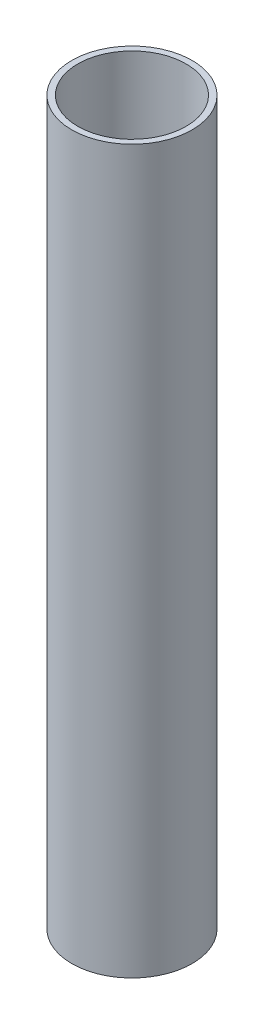
ISO-10303-21;
HEADER;
FILE_DESCRIPTION(('STEP AP214'),'2;1');
FILE_NAME('part.step','',(''),(''),'','','');
FILE_SCHEMA(('AUTOMOTIVE_DESIGN { 1 0 10303 214 1 1 1 1 }'));
ENDSEC;
DATA;
#1=APPLICATION_CONTEXT('core data for automotive mechanical design processes');
#2=APPLICATION_PROTOCOL_DEFINITION('international standard','automotive_design',2000,#1);
#3=PRODUCT_CONTEXT('',#1,'mechanical');
#4=PRODUCT('Part','Part','',(#3));
#5=PRODUCT_RELATED_PRODUCT_CATEGORY('part','',(#4));
#6=PRODUCT_DEFINITION_FORMATION('','',#4);
#7=PRODUCT_DEFINITION_CONTEXT('part definition',#1,'design');
#8=PRODUCT_DEFINITION('design','',#6,#7);
#9=PRODUCT_DEFINITION_SHAPE('','',#8);
#10=(LENGTH_UNIT() NAMED_UNIT(*) SI_UNIT(.MILLI.,.METRE.));
#11=(NAMED_UNIT(*) PLANE_ANGLE_UNIT() SI_UNIT($,.RADIAN.));
#12=(NAMED_UNIT(*) SI_UNIT($,.STERADIAN.) SOLID_ANGLE_UNIT());
#13=UNCERTAINTY_MEASURE_WITH_UNIT(LENGTH_MEASURE(1.E-05),#10,'distance_accuracy_value','');
#14=(GEOMETRIC_REPRESENTATION_CONTEXT(3) GLOBAL_UNCERTAINTY_ASSIGNED_CONTEXT((#13)) GLOBAL_UNIT_ASSIGNED_CONTEXT((#10,
#11,#12)) REPRESENTATION_CONTEXT('',''));
#15=CARTESIAN_POINT('',(0.,0.,0.));
#16=DIRECTION('',(0.,0.,1.));
#17=DIRECTION('',(1.,0.,0.));
#18=AXIS2_PLACEMENT_3D('',#15,#16,#17);
#19=CARTESIAN_POINT('',(0.,300.,0.));
#20=DIRECTION('',(0.,1.,0.));
#21=DIRECTION('',(0.,0.,1.));
#22=AXIS2_PLACEMENT_3D('',#19,#20,#21);
#23=PLANE('',#22);
#24=CARTESIAN_POINT('',(0.,300.,0.));
#25=DIRECTION('',(0.,1.,0.));
#26=DIRECTION('',(0.,0.,1.));
#27=AXIS2_PLACEMENT_3D('',#24,#25,#26);
#28=CIRCLE('',#27,25.);
#29=CARTESIAN_POINT('',(0.,300.,25.));
#30=VERTEX_POINT('',#29);
#31=EDGE_CURVE('E10',#30,#30,#28,.T.);
#32=ORIENTED_EDGE('',*,*,#31,.T.);
#33=EDGE_LOOP('',(#32));
#34=FACE_BOUND('',#33,.T.);
#35=CARTESIAN_POINT('',(0.,300.,0.));
#36=DIRECTION('',(0.,1.,0.));
#37=DIRECTION('',(0.,0.,1.));
#38=AXIS2_PLACEMENT_3D('',#35,#36,#37);
#39=CIRCLE('',#38,22.5);
#40=CARTESIAN_POINT('',(0.,300.,22.5));
#41=VERTEX_POINT('',#40);
#42=EDGE_CURVE('E54',#41,#41,#39,.T.);
#43=ORIENTED_EDGE('',*,*,#42,.F.);
#44=EDGE_LOOP('',(#43));
#45=FACE_BOUND('',#44,.T.);
#46=ADVANCED_FACE('F41',(#34,#45),#23,.T.);
#47=CARTESIAN_POINT('',(0.,0.,0.));
#48=DIRECTION('',(0.,1.,0.));
#49=DIRECTION('',(0.,0.,1.));
#50=AXIS2_PLACEMENT_3D('',#47,#48,#49);
#51=PLANE('',#50);
#52=CARTESIAN_POINT('',(0.,0.,0.));
#53=DIRECTION('',(0.,1.,0.));
#54=DIRECTION('',(0.,0.,1.));
#55=AXIS2_PLACEMENT_3D('',#52,#53,#54);
#56=CIRCLE('',#55,25.);
#57=CARTESIAN_POINT('',(0.,0.,25.));
#58=VERTEX_POINT('',#57);
#59=EDGE_CURVE('E45',#58,#58,#56,.T.);
#60=ORIENTED_EDGE('',*,*,#59,.F.);
#61=EDGE_LOOP('',(#60));
#62=FACE_BOUND('',#61,.T.);
#63=CARTESIAN_POINT('',(0.,0.,0.));
#64=DIRECTION('',(0.,1.,0.));
#65=DIRECTION('',(0.,0.,1.));
#66=AXIS2_PLACEMENT_3D('',#63,#64,#65);
#67=CIRCLE('',#66,22.5);
#68=CARTESIAN_POINT('',(0.,0.,22.5));
#69=VERTEX_POINT('',#68);
#70=EDGE_CURVE('E56',#69,#69,#67,.T.);
#71=ORIENTED_EDGE('',*,*,#70,.T.);
#72=EDGE_LOOP('',(#71));
#73=FACE_BOUND('',#72,.T.);
#74=ADVANCED_FACE('F68',(#62,#73),#51,.F.);
#75=CARTESIAN_POINT('',(0.,300.,0.));
#76=DIRECTION('',(0.,-1.,0.));
#77=DIRECTION('',(0.,0.,-1.));
#78=AXIS2_PLACEMENT_3D('',#75,#76,#77);
#79=CYLINDRICAL_SURFACE('',#78,25.);
#80=ORIENTED_EDGE('',*,*,#31,.F.);
#81=EDGE_LOOP('',(#80));
#82=FACE_BOUND('',#81,.T.);
#83=ORIENTED_EDGE('',*,*,#59,.T.);
#84=EDGE_LOOP('',(#83));
#85=FACE_BOUND('',#84,.T.);
#86=ADVANCED_FACE('F43',(#82,#85),#79,.T.);
#87=CARTESIAN_POINT('',(0.,300.,0.));
#88=DIRECTION('',(0.,-1.,0.));
#89=DIRECTION('',(0.,0.,-1.));
#90=AXIS2_PLACEMENT_3D('',#87,#88,#89);
#91=CYLINDRICAL_SURFACE('',#90,22.5);
#92=ORIENTED_EDGE('',*,*,#42,.T.);
#93=EDGE_LOOP('',(#92));
#94=FACE_BOUND('',#93,.T.);
#95=ORIENTED_EDGE('',*,*,#70,.F.);
#96=EDGE_LOOP('',(#95));
#97=FACE_BOUND('',#96,.T.);
#98=ADVANCED_FACE('F64',(#94,#97),#91,.F.);
#99=CLOSED_SHELL('',(#46,#74,#86,#98));
#100=MANIFOLD_SOLID_BREP('B2',#99);
#101=ADVANCED_BREP_SHAPE_REPRESENTATION('',(#18,#100),#14);
#102=SHAPE_DEFINITION_REPRESENTATION(#9,#101);
ENDSEC;
END-ISO-10303-21;
